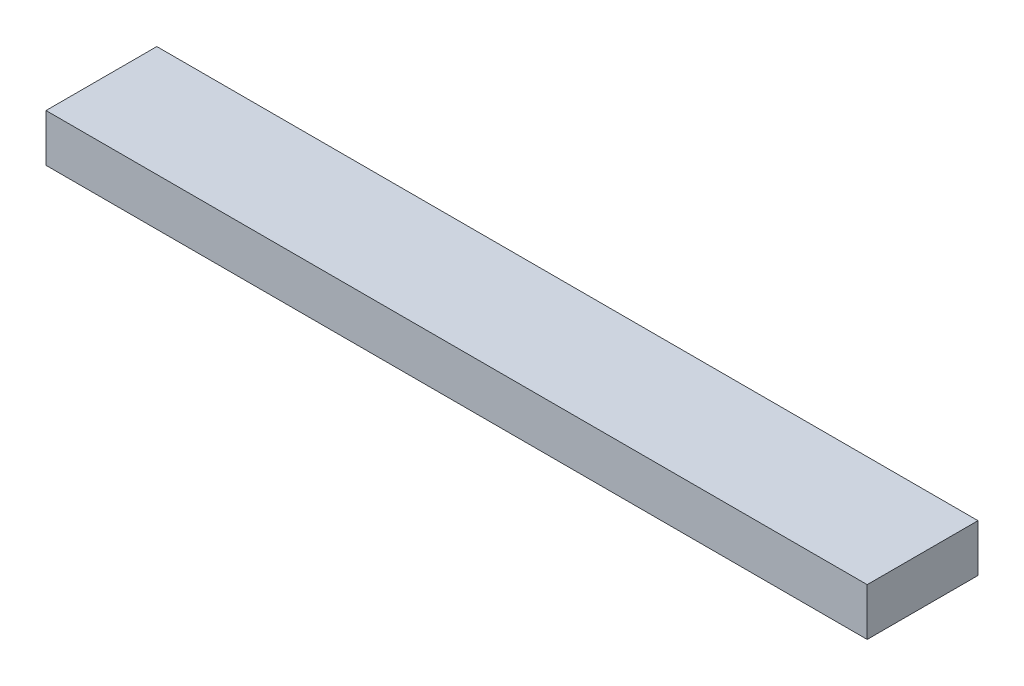
ISO-10303-21;
HEADER;
FILE_DESCRIPTION(('STEP AP214'),'2;1');
FILE_NAME('part.step','',(''),(''),'','','');
FILE_SCHEMA(('AUTOMOTIVE_DESIGN { 1 0 10303 214 1 1 1 1 }'));
ENDSEC;
DATA;
#1=APPLICATION_CONTEXT('core data for automotive mechanical design processes');
#2=APPLICATION_PROTOCOL_DEFINITION('international standard','automotive_design',2000,#1);
#3=PRODUCT_CONTEXT('',#1,'mechanical');
#4=PRODUCT('Part','Part','',(#3));
#5=PRODUCT_RELATED_PRODUCT_CATEGORY('part','',(#4));
#6=PRODUCT_DEFINITION_FORMATION('','',#4);
#7=PRODUCT_DEFINITION_CONTEXT('part definition',#1,'design');
#8=PRODUCT_DEFINITION('design','',#6,#7);
#9=PRODUCT_DEFINITION_SHAPE('','',#8);
#10=(LENGTH_UNIT() NAMED_UNIT(*) SI_UNIT(.MILLI.,.METRE.));
#11=(NAMED_UNIT(*) PLANE_ANGLE_UNIT() SI_UNIT($,.RADIAN.));
#12=(NAMED_UNIT(*) SI_UNIT($,.STERADIAN.) SOLID_ANGLE_UNIT());
#13=UNCERTAINTY_MEASURE_WITH_UNIT(LENGTH_MEASURE(1.E-05),#10,'distance_accuracy_value','');
#14=(GEOMETRIC_REPRESENTATION_CONTEXT(3) GLOBAL_UNCERTAINTY_ASSIGNED_CONTEXT((#13)) GLOBAL_UNIT_ASSIGNED_CONTEXT((#10,
#11,#12)) REPRESENTATION_CONTEXT('',''));
#15=CARTESIAN_POINT('',(0.,0.,0.));
#16=DIRECTION('',(0.,0.,1.));
#17=DIRECTION('',(1.,0.,0.));
#18=AXIS2_PLACEMENT_3D('',#15,#16,#17);
#19=CARTESIAN_POINT('',(0.,38.1,0.));
#20=DIRECTION('',(1.,0.,0.));
#21=DIRECTION('',(0.,0.,-1.));
#22=AXIS2_PLACEMENT_3D('',#19,#20,#21);
#23=PLANE('',#22);
#24=DIRECTION('',(0.,0.,1.));
#25=VECTOR('',#24,1.);
#26=CARTESIAN_POINT('',(0.,0.,0.));
#27=LINE('',#26,#25);
#28=CARTESIAN_POINT('',(0.,0.,-88.9));
#29=VERTEX_POINT('',#28);
#30=CARTESIAN_POINT('',(0.,0.,0.));
#31=VERTEX_POINT('',#30);
#32=EDGE_CURVE('E102',#29,#31,#27,.T.);
#33=ORIENTED_EDGE('',*,*,#32,.T.);
#34=DIRECTION('',(0.,-1.,0.));
#35=VECTOR('',#34,1.);
#36=CARTESIAN_POINT('',(0.,38.1,0.));
#37=LINE('',#36,#35);
#38=CARTESIAN_POINT('',(0.,38.1,0.));
#39=VERTEX_POINT('',#38);
#40=EDGE_CURVE('E11',#39,#31,#37,.T.);
#41=ORIENTED_EDGE('',*,*,#40,.F.);
#42=DIRECTION('',(0.,0.,1.));
#43=VECTOR('',#42,1.);
#44=CARTESIAN_POINT('',(0.,38.1,0.));
#45=LINE('',#44,#43);
#46=CARTESIAN_POINT('',(0.,38.1,-88.9));
#47=VERTEX_POINT('',#46);
#48=EDGE_CURVE('E90',#47,#39,#45,.T.);
#49=ORIENTED_EDGE('',*,*,#48,.F.);
#50=DIRECTION('',(0.,-1.,0.));
#51=VECTOR('',#50,1.);
#52=CARTESIAN_POINT('',(0.,38.1,-88.9));
#53=LINE('',#52,#51);
#54=EDGE_CURVE('E98',#47,#29,#53,.T.);
#55=ORIENTED_EDGE('',*,*,#54,.T.);
#56=EDGE_LOOP('',(#33,#41,#49,#55));
#57=FACE_BOUND('',#56,.T.);
#58=ADVANCED_FACE('F39',(#57),#23,.F.);
#59=CARTESIAN_POINT('',(0.,38.1,0.));
#60=DIRECTION('',(0.,0.,-1.));
#61=DIRECTION('',(-1.,0.,0.));
#62=AXIS2_PLACEMENT_3D('',#59,#60,#61);
#63=PLANE('',#62);
#64=DIRECTION('',(1.,0.,0.));
#65=VECTOR('',#64,1.);
#66=CARTESIAN_POINT('',(0.,0.,0.));
#67=LINE('',#66,#65);
#68=CARTESIAN_POINT('',(658.8125,0.,0.));
#69=VERTEX_POINT('',#68);
#70=EDGE_CURVE('E94',#31,#69,#67,.T.);
#71=ORIENTED_EDGE('',*,*,#70,.T.);
#72=DIRECTION('',(0.,-1.,0.));
#73=VECTOR('',#72,1.);
#74=CARTESIAN_POINT('',(658.8125,38.1,0.));
#75=LINE('',#74,#73);
#76=CARTESIAN_POINT('',(658.8125,38.1,0.));
#77=VERTEX_POINT('',#76);
#78=EDGE_CURVE('E47',#77,#69,#75,.T.);
#79=ORIENTED_EDGE('',*,*,#78,.F.);
#80=DIRECTION('',(1.,0.,0.));
#81=VECTOR('',#80,1.);
#82=CARTESIAN_POINT('',(0.,38.1,0.));
#83=LINE('',#82,#81);
#84=EDGE_CURVE('E85',#39,#77,#83,.T.);
#85=ORIENTED_EDGE('',*,*,#84,.F.);
#86=ORIENTED_EDGE('',*,*,#40,.T.);
#87=EDGE_LOOP('',(#71,#79,#85,#86));
#88=FACE_BOUND('',#87,.T.);
#89=ADVANCED_FACE('F93',(#88),#63,.F.);
#90=CARTESIAN_POINT('',(658.8125,38.1,0.));
#91=DIRECTION('',(-1.,0.,0.));
#92=DIRECTION('',(0.,0.,1.));
#93=AXIS2_PLACEMENT_3D('',#90,#91,#92);
#94=PLANE('',#93);
#95=DIRECTION('',(0.,0.,-1.));
#96=VECTOR('',#95,1.);
#97=CARTESIAN_POINT('',(658.8125,0.,0.));
#98=LINE('',#97,#96);
#99=CARTESIAN_POINT('',(658.8125,0.,-88.9));
#100=VERTEX_POINT('',#99);
#101=EDGE_CURVE('E72',#69,#100,#98,.T.);
#102=ORIENTED_EDGE('',*,*,#101,.T.);
#103=DIRECTION('',(0.,-1.,0.));
#104=VECTOR('',#103,1.);
#105=CARTESIAN_POINT('',(658.8125,38.1,-88.9));
#106=LINE('',#105,#104);
#107=CARTESIAN_POINT('',(658.8125,38.1,-88.9));
#108=VERTEX_POINT('',#107);
#109=EDGE_CURVE('E95',#108,#100,#106,.T.);
#110=ORIENTED_EDGE('',*,*,#109,.F.);
#111=DIRECTION('',(0.,0.,-1.));
#112=VECTOR('',#111,1.);
#113=CARTESIAN_POINT('',(658.8125,38.1,0.));
#114=LINE('',#113,#112);
#115=EDGE_CURVE('E88',#77,#108,#114,.T.);
#116=ORIENTED_EDGE('',*,*,#115,.F.);
#117=ORIENTED_EDGE('',*,*,#78,.T.);
#118=EDGE_LOOP('',(#102,#110,#116,#117));
#119=FACE_BOUND('',#118,.T.);
#120=ADVANCED_FACE('F96',(#119),#94,.F.);
#121=CARTESIAN_POINT('',(0.,38.1,-88.9));
#122=DIRECTION('',(0.,0.,1.));
#123=DIRECTION('',(1.,0.,0.));
#124=AXIS2_PLACEMENT_3D('',#121,#122,#123);
#125=PLANE('',#124);
#126=DIRECTION('',(-1.,0.,0.));
#127=VECTOR('',#126,1.);
#128=CARTESIAN_POINT('',(0.,0.,-88.9));
#129=LINE('',#128,#127);
#130=EDGE_CURVE('E78',#100,#29,#129,.T.);
#131=ORIENTED_EDGE('',*,*,#130,.T.);
#132=ORIENTED_EDGE('',*,*,#54,.F.);
#133=DIRECTION('',(-1.,0.,0.));
#134=VECTOR('',#133,1.);
#135=CARTESIAN_POINT('',(0.,38.1,-88.9));
#136=LINE('',#135,#134);
#137=EDGE_CURVE('E55',#108,#47,#136,.T.);
#138=ORIENTED_EDGE('',*,*,#137,.F.);
#139=ORIENTED_EDGE('',*,*,#109,.T.);
#140=EDGE_LOOP('',(#131,#132,#138,#139));
#141=FACE_BOUND('',#140,.T.);
#142=ADVANCED_FACE('F109',(#141),#125,.F.);
#143=CARTESIAN_POINT('',(0.,38.1,0.));
#144=DIRECTION('',(0.,-1.,0.));
#145=DIRECTION('',(0.,0.,-1.));
#146=AXIS2_PLACEMENT_3D('',#143,#144,#145);
#147=PLANE('',#146);
#148=ORIENTED_EDGE('',*,*,#48,.T.);
#149=ORIENTED_EDGE('',*,*,#84,.T.);
#150=ORIENTED_EDGE('',*,*,#115,.T.);
#151=ORIENTED_EDGE('',*,*,#137,.T.);
#152=EDGE_LOOP('',(#148,#149,#150,#151));
#153=FACE_BOUND('',#152,.T.);
#154=ADVANCED_FACE('F86',(#153),#147,.F.);
#155=CARTESIAN_POINT('',(0.,0.,0.));
#156=DIRECTION('',(0.,-1.,0.));
#157=DIRECTION('',(0.,0.,-1.));
#158=AXIS2_PLACEMENT_3D('',#155,#156,#157);
#159=PLANE('',#158);
#160=ORIENTED_EDGE('',*,*,#32,.F.);
#161=ORIENTED_EDGE('',*,*,#130,.F.);
#162=ORIENTED_EDGE('',*,*,#101,.F.);
#163=ORIENTED_EDGE('',*,*,#70,.F.);
#164=EDGE_LOOP('',(#160,#161,#162,#163));
#165=FACE_BOUND('',#164,.T.);
#166=ADVANCED_FACE('F112',(#165),#159,.T.);
#167=CLOSED_SHELL('',(#58,#89,#120,#142,#154,#166));
#168=MANIFOLD_SOLID_BREP('B2',#167);
#169=ADVANCED_BREP_SHAPE_REPRESENTATION('',(#18,#168),#14);
#170=SHAPE_DEFINITION_REPRESENTATION(#9,#169);
ENDSEC;
END-ISO-10303-21;
